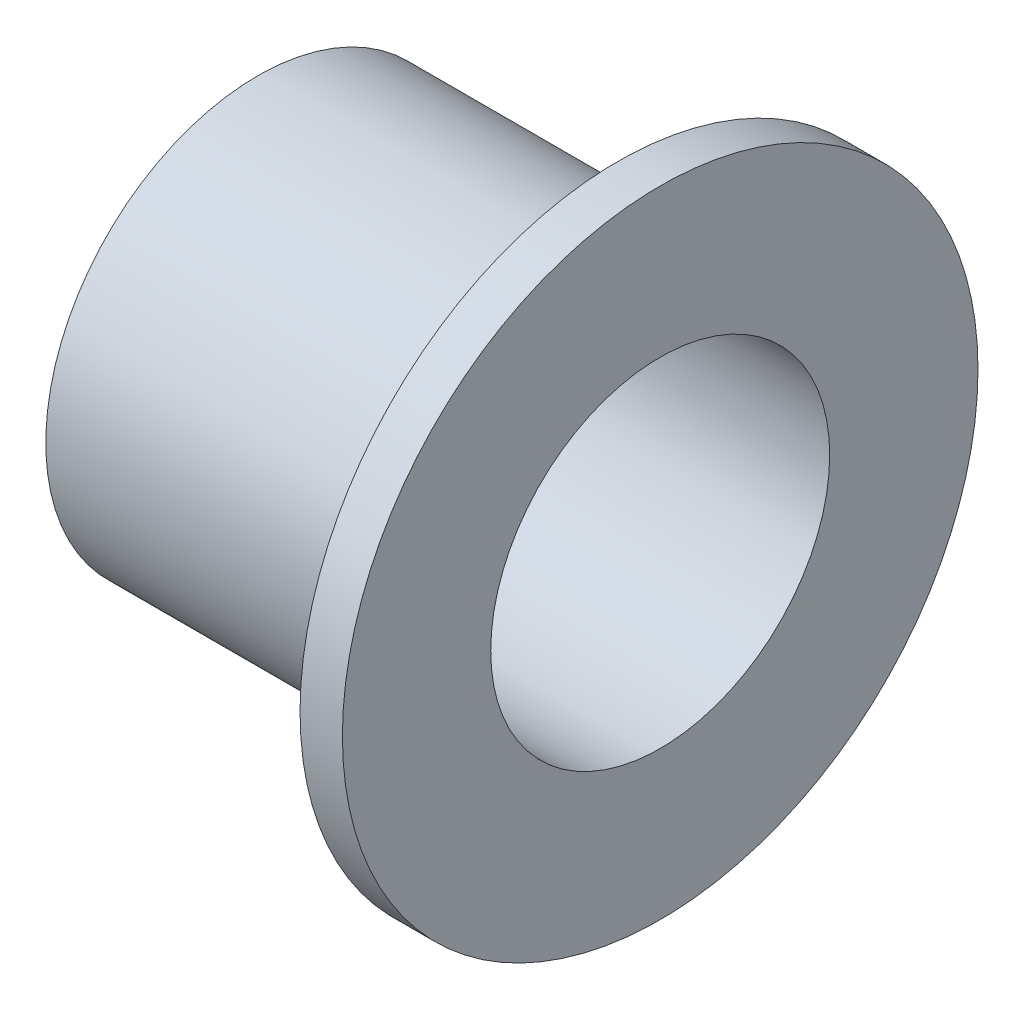
ISO-10303-21;
HEADER;
FILE_DESCRIPTION(('STEP AP214'),'2;1');
FILE_NAME('part.step','',(''),(''),'','','');
FILE_SCHEMA(('AUTOMOTIVE_DESIGN { 1 0 10303 214 1 1 1 1 }'));
ENDSEC;
DATA;
#1=APPLICATION_CONTEXT('core data for automotive mechanical design processes');
#2=APPLICATION_PROTOCOL_DEFINITION('international standard','automotive_design',2000,#1);
#3=PRODUCT_CONTEXT('',#1,'mechanical');
#4=PRODUCT('Part','Part','',(#3));
#5=PRODUCT_RELATED_PRODUCT_CATEGORY('part','',(#4));
#6=PRODUCT_DEFINITION_FORMATION('','',#4);
#7=PRODUCT_DEFINITION_CONTEXT('part definition',#1,'design');
#8=PRODUCT_DEFINITION('design','',#6,#7);
#9=PRODUCT_DEFINITION_SHAPE('','',#8);
#10=(LENGTH_UNIT() NAMED_UNIT(*) SI_UNIT(.MILLI.,.METRE.));
#11=(NAMED_UNIT(*) PLANE_ANGLE_UNIT() SI_UNIT($,.RADIAN.));
#12=(NAMED_UNIT(*) SI_UNIT($,.STERADIAN.) SOLID_ANGLE_UNIT());
#13=UNCERTAINTY_MEASURE_WITH_UNIT(LENGTH_MEASURE(1.E-05),#10,'distance_accuracy_value','');
#14=(GEOMETRIC_REPRESENTATION_CONTEXT(3) GLOBAL_UNCERTAINTY_ASSIGNED_CONTEXT((#13)) GLOBAL_UNIT_ASSIGNED_CONTEXT((#10,
#11,#12)) REPRESENTATION_CONTEXT('',''));
#15=CARTESIAN_POINT('',(0.,0.,0.));
#16=DIRECTION('',(0.,0.,1.));
#17=DIRECTION('',(1.,0.,0.));
#18=AXIS2_PLACEMENT_3D('',#15,#16,#17);
#19=CARTESIAN_POINT('',(0.,0.,0.));
#20=DIRECTION('',(1.,0.,0.));
#21=DIRECTION('',(0.,0.,-1.));
#22=AXIS2_PLACEMENT_3D('',#19,#20,#21);
#23=PLANE('',#22);
#24=CARTESIAN_POINT('',(0.,0.,0.));
#25=DIRECTION('',(1.,0.,0.));
#26=DIRECTION('',(0.,0.,-1.));
#27=AXIS2_PLACEMENT_3D('',#24,#25,#26);
#28=CIRCLE('',#27,5.);
#29=CARTESIAN_POINT('',(0.,0.,-5.));
#30=VERTEX_POINT('',#29);
#31=EDGE_CURVE('E36',#30,#30,#28,.T.);
#32=ORIENTED_EDGE('',*,*,#31,.F.);
#33=EDGE_LOOP('',(#32));
#34=FACE_BOUND('',#33,.T.);
#35=CARTESIAN_POINT('',(0.,0.,0.));
#36=DIRECTION('',(1.,0.,0.));
#37=DIRECTION('',(0.,0.,-1.));
#38=AXIS2_PLACEMENT_3D('',#35,#36,#37);
#39=CIRCLE('',#38,4.);
#40=CARTESIAN_POINT('',(0.,0.,-4.));
#41=VERTEX_POINT('',#40);
#42=EDGE_CURVE('E43',#41,#41,#39,.T.);
#43=ORIENTED_EDGE('',*,*,#42,.T.);
#44=EDGE_LOOP('',(#43));
#45=FACE_BOUND('',#44,.T.);
#46=ADVANCED_FACE('F32',(#34,#45),#23,.F.);
#47=CARTESIAN_POINT('',(8.5,0.,0.));
#48=DIRECTION('',(-1.,0.,0.));
#49=DIRECTION('',(0.,0.,1.));
#50=AXIS2_PLACEMENT_3D('',#47,#48,#49);
#51=CYLINDRICAL_SURFACE('',#50,5.);
#52=CARTESIAN_POINT('',(8.5,0.,0.));
#53=DIRECTION('',(1.,0.,0.));
#54=DIRECTION('',(0.,0.,-1.));
#55=AXIS2_PLACEMENT_3D('',#52,#53,#54);
#56=CIRCLE('',#55,5.);
#57=CARTESIAN_POINT('',(8.5,0.,-5.));
#58=VERTEX_POINT('',#57);
#59=EDGE_CURVE('E10',#58,#58,#56,.T.);
#60=ORIENTED_EDGE('',*,*,#59,.F.);
#61=EDGE_LOOP('',(#60));
#62=FACE_BOUND('',#61,.T.);
#63=ORIENTED_EDGE('',*,*,#31,.T.);
#64=EDGE_LOOP('',(#63));
#65=FACE_BOUND('',#64,.T.);
#66=ADVANCED_FACE('F34',(#62,#65),#51,.T.);
#67=CARTESIAN_POINT('',(8.5,0.,0.));
#68=DIRECTION('',(-1.,0.,0.));
#69=DIRECTION('',(0.,0.,1.));
#70=AXIS2_PLACEMENT_3D('',#67,#68,#69);
#71=CYLINDRICAL_SURFACE('',#70,4.);
#72=ORIENTED_EDGE('',*,*,#42,.F.);
#73=EDGE_LOOP('',(#72));
#74=FACE_BOUND('',#73,.T.);
#75=CARTESIAN_POINT('',(9.5,0.,0.));
#76=DIRECTION('',(1.,0.,0.));
#77=DIRECTION('',(0.,0.,-1.));
#78=AXIS2_PLACEMENT_3D('',#75,#76,#77);
#79=CIRCLE('',#78,4.);
#80=CARTESIAN_POINT('',(9.5,0.,-4.));
#81=VERTEX_POINT('',#80);
#82=EDGE_CURVE('E51',#81,#81,#79,.T.);
#83=ORIENTED_EDGE('',*,*,#82,.T.);
#84=EDGE_LOOP('',(#83));
#85=FACE_BOUND('',#84,.T.);
#86=ADVANCED_FACE('F57',(#74,#85),#71,.F.);
#87=CARTESIAN_POINT('',(9.5,0.,0.));
#88=DIRECTION('',(1.,0.,0.));
#89=DIRECTION('',(0.,0.,-1.));
#90=AXIS2_PLACEMENT_3D('',#87,#88,#89);
#91=PLANE('',#90);
#92=CARTESIAN_POINT('',(9.5,0.,0.));
#93=DIRECTION('',(1.,0.,0.));
#94=DIRECTION('',(0.,0.,-1.));
#95=AXIS2_PLACEMENT_3D('',#92,#93,#94);
#96=CIRCLE('',#95,7.5);
#97=CARTESIAN_POINT('',(9.5,0.,-7.5));
#98=VERTEX_POINT('',#97);
#99=EDGE_CURVE('E47',#98,#98,#96,.T.);
#100=ORIENTED_EDGE('',*,*,#99,.T.);
#101=EDGE_LOOP('',(#100));
#102=FACE_BOUND('',#101,.T.);
#103=ORIENTED_EDGE('',*,*,#82,.F.);
#104=EDGE_LOOP('',(#103));
#105=FACE_BOUND('',#104,.T.);
#106=ADVANCED_FACE('F59',(#102,#105),#91,.T.);
#107=CARTESIAN_POINT('',(8.5,0.,0.));
#108=DIRECTION('',(1.,0.,0.));
#109=DIRECTION('',(0.,0.,-1.));
#110=AXIS2_PLACEMENT_3D('',#107,#108,#109);
#111=PLANE('',#110);
#112=ORIENTED_EDGE('',*,*,#59,.T.);
#113=EDGE_LOOP('',(#112));
#114=FACE_BOUND('',#113,.T.);
#115=CARTESIAN_POINT('',(8.5,0.,0.));
#116=DIRECTION('',(1.,0.,0.));
#117=DIRECTION('',(0.,0.,-1.));
#118=AXIS2_PLACEMENT_3D('',#115,#116,#117);
#119=CIRCLE('',#118,7.5);
#120=CARTESIAN_POINT('',(8.5,0.,-7.5));
#121=VERTEX_POINT('',#120);
#122=EDGE_CURVE('E48',#121,#121,#119,.T.);
#123=ORIENTED_EDGE('',*,*,#122,.F.);
#124=EDGE_LOOP('',(#123));
#125=FACE_BOUND('',#124,.T.);
#126=ADVANCED_FACE('F61',(#114,#125),#111,.F.);
#127=CARTESIAN_POINT('',(9.5,0.,0.));
#128=DIRECTION('',(-1.,0.,0.));
#129=DIRECTION('',(0.,0.,1.));
#130=AXIS2_PLACEMENT_3D('',#127,#128,#129);
#131=CYLINDRICAL_SURFACE('',#130,7.5);
#132=ORIENTED_EDGE('',*,*,#99,.F.);
#133=EDGE_LOOP('',(#132));
#134=FACE_BOUND('',#133,.T.);
#135=ORIENTED_EDGE('',*,*,#122,.T.);
#136=EDGE_LOOP('',(#135));
#137=FACE_BOUND('',#136,.T.);
#138=ADVANCED_FACE('F68',(#134,#137),#131,.T.);
#139=CLOSED_SHELL('',(#46,#66,#86,#106,#126,#138));
#140=MANIFOLD_SOLID_BREP('B2',#139);
#141=ADVANCED_BREP_SHAPE_REPRESENTATION('',(#18,#140),#14);
#142=SHAPE_DEFINITION_REPRESENTATION(#9,#141);
ENDSEC;
END-ISO-10303-21;
